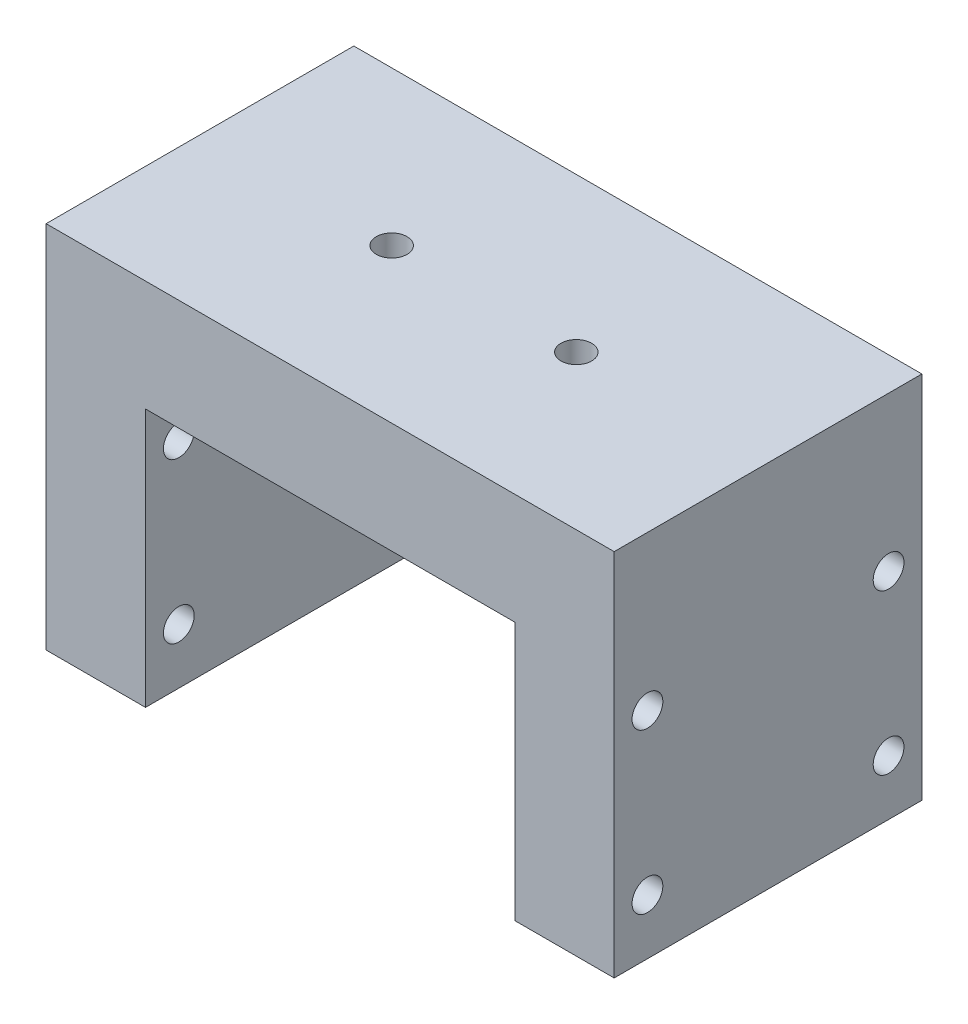
ISO-10303-21;
HEADER;
FILE_DESCRIPTION(('STEP AP214'),'2;1');
FILE_NAME('part.step','',(''),(''),'','','');
FILE_SCHEMA(('AUTOMOTIVE_DESIGN { 1 0 10303 214 1 1 1 1 }'));
ENDSEC;
DATA;
#1=APPLICATION_CONTEXT('core data for automotive mechanical design processes');
#2=APPLICATION_PROTOCOL_DEFINITION('international standard','automotive_design',2000,#1);
#3=PRODUCT_CONTEXT('',#1,'mechanical');
#4=PRODUCT('Part','Part','',(#3));
#5=PRODUCT_RELATED_PRODUCT_CATEGORY('part','',(#4));
#6=PRODUCT_DEFINITION_FORMATION('','',#4);
#7=PRODUCT_DEFINITION_CONTEXT('part definition',#1,'design');
#8=PRODUCT_DEFINITION('design','',#6,#7);
#9=PRODUCT_DEFINITION_SHAPE('','',#8);
#10=(LENGTH_UNIT() NAMED_UNIT(*) SI_UNIT(.MILLI.,.METRE.));
#11=(NAMED_UNIT(*) PLANE_ANGLE_UNIT() SI_UNIT($,.RADIAN.));
#12=(NAMED_UNIT(*) SI_UNIT($,.STERADIAN.) SOLID_ANGLE_UNIT());
#13=UNCERTAINTY_MEASURE_WITH_UNIT(LENGTH_MEASURE(1.E-05),#10,'distance_accuracy_value','');
#14=(GEOMETRIC_REPRESENTATION_CONTEXT(3) GLOBAL_UNCERTAINTY_ASSIGNED_CONTEXT((#13)) GLOBAL_UNIT_ASSIGNED_CONTEXT((#10,
#11,#12)) REPRESENTATION_CONTEXT('',''));
#15=CARTESIAN_POINT('',(0.,0.,0.));
#16=DIRECTION('',(0.,0.,1.));
#17=DIRECTION('',(1.,0.,0.));
#18=AXIS2_PLACEMENT_3D('',#15,#16,#17);
#19=CARTESIAN_POINT('',(-15.,-21.,12.5));
#20=DIRECTION('',(0.,1.,0.));
#21=DIRECTION('',(0.,0.,1.));
#22=AXIS2_PLACEMENT_3D('',#19,#20,#21);
#23=PLANE('',#22);
#24=DIRECTION('',(1.,0.,0.));
#25=VECTOR('',#24,1.);
#26=CARTESIAN_POINT('',(-15.,-21.,-12.5));
#27=LINE('',#26,#25);
#28=CARTESIAN_POINT('',(-23.075,-21.,-12.5));
#29=VERTEX_POINT('',#28);
#30=CARTESIAN_POINT('',(-15.,-21.,-12.5));
#31=VERTEX_POINT('',#30);
#32=EDGE_CURVE('E144',#29,#31,#27,.T.);
#33=ORIENTED_EDGE('',*,*,#32,.T.);
#34=DIRECTION('',(0.,0.,-1.));
#35=VECTOR('',#34,1.);
#36=CARTESIAN_POINT('',(-15.,-21.,12.5));
#37=LINE('',#36,#35);
#38=CARTESIAN_POINT('',(-15.,-21.,12.5));
#39=VERTEX_POINT('',#38);
#40=EDGE_CURVE('E11',#39,#31,#37,.T.);
#41=ORIENTED_EDGE('',*,*,#40,.F.);
#42=DIRECTION('',(1.,0.,0.));
#43=VECTOR('',#42,1.);
#44=CARTESIAN_POINT('',(-15.,-21.,12.5));
#45=LINE('',#44,#43);
#46=CARTESIAN_POINT('',(-23.075,-21.,12.5));
#47=VERTEX_POINT('',#46);
#48=EDGE_CURVE('E159',#47,#39,#45,.T.);
#49=ORIENTED_EDGE('',*,*,#48,.F.);
#50=DIRECTION('',(0.,0.,-1.));
#51=VECTOR('',#50,1.);
#52=CARTESIAN_POINT('',(-23.075,-21.,12.5));
#53=LINE('',#52,#51);
#54=EDGE_CURVE('E140',#47,#29,#53,.T.);
#55=ORIENTED_EDGE('',*,*,#54,.T.);
#56=EDGE_LOOP('',(#33,#41,#49,#55));
#57=FACE_BOUND('',#56,.T.);
#58=ADVANCED_FACE('F45',(#57),#23,.F.);
#59=CARTESIAN_POINT('',(-15.,0.,12.5));
#60=DIRECTION('',(-1.,0.,0.));
#61=DIRECTION('',(0.,-1.,0.));
#62=AXIS2_PLACEMENT_3D('',#59,#60,#61);
#63=PLANE('',#62);
#64=CARTESIAN_POINT('',(-15.,-3.53,-9.795));
#65=DIRECTION('',(-1.,0.,0.));
#66=DIRECTION('',(0.,-1.,0.));
#67=AXIS2_PLACEMENT_3D('',#64,#65,#66);
#68=CIRCLE('',#67,1.24999999999999);
#69=CARTESIAN_POINT('',(-15.,-4.77999999999999,-9.795));
#70=VERTEX_POINT('',#69);
#71=EDGE_CURVE('E239',#70,#70,#68,.T.);
#72=ORIENTED_EDGE('',*,*,#71,.T.);
#73=EDGE_LOOP('',(#72));
#74=FACE_BOUND('',#73,.T.);
#75=CARTESIAN_POINT('',(-15.,-16.5,9.795));
#76=DIRECTION('',(-1.,0.,0.));
#77=DIRECTION('',(0.,-1.,0.));
#78=AXIS2_PLACEMENT_3D('',#75,#76,#77);
#79=CIRCLE('',#78,1.24999999999999);
#80=CARTESIAN_POINT('',(-15.,-17.75,9.795));
#81=VERTEX_POINT('',#80);
#82=EDGE_CURVE('E227',#81,#81,#79,.T.);
#83=ORIENTED_EDGE('',*,*,#82,.T.);
#84=EDGE_LOOP('',(#83));
#85=FACE_BOUND('',#84,.T.);
#86=CARTESIAN_POINT('',(-15.,-16.5,-9.795));
#87=DIRECTION('',(-1.,0.,0.));
#88=DIRECTION('',(0.,-1.,0.));
#89=AXIS2_PLACEMENT_3D('',#86,#87,#88);
#90=CIRCLE('',#89,1.24999999999999);
#91=CARTESIAN_POINT('',(-15.,-17.75,-9.795));
#92=VERTEX_POINT('',#91);
#93=EDGE_CURVE('E215',#92,#92,#90,.T.);
#94=ORIENTED_EDGE('',*,*,#93,.T.);
#95=EDGE_LOOP('',(#94));
#96=FACE_BOUND('',#95,.T.);
#97=CARTESIAN_POINT('',(-15.,-3.53,9.795));
#98=DIRECTION('',(-1.,0.,0.));
#99=DIRECTION('',(0.,-1.,0.));
#100=AXIS2_PLACEMENT_3D('',#97,#98,#99);
#101=CIRCLE('',#100,1.24999999999999);
#102=CARTESIAN_POINT('',(-15.,-4.77999999999999,9.795));
#103=VERTEX_POINT('',#102);
#104=EDGE_CURVE('E203',#103,#103,#101,.T.);
#105=ORIENTED_EDGE('',*,*,#104,.T.);
#106=EDGE_LOOP('',(#105));
#107=FACE_BOUND('',#106,.T.);
#108=DIRECTION('',(0.,1.,0.));
#109=VECTOR('',#108,1.);
#110=CARTESIAN_POINT('',(-15.,0.,-12.5));
#111=LINE('',#110,#109);
#112=CARTESIAN_POINT('',(-15.,0.,-12.5));
#113=VERTEX_POINT('',#112);
#114=EDGE_CURVE('E147',#31,#113,#111,.T.);
#115=ORIENTED_EDGE('',*,*,#114,.T.);
#116=DIRECTION('',(0.,0.,-1.));
#117=VECTOR('',#116,1.);
#118=CARTESIAN_POINT('',(-15.,0.,12.5));
#119=LINE('',#118,#117);
#120=CARTESIAN_POINT('',(-15.,0.,12.5));
#121=VERTEX_POINT('',#120);
#122=EDGE_CURVE('E53',#121,#113,#119,.T.);
#123=ORIENTED_EDGE('',*,*,#122,.F.);
#124=DIRECTION('',(0.,1.,0.));
#125=VECTOR('',#124,1.);
#126=CARTESIAN_POINT('',(-15.,0.,12.5));
#127=LINE('',#126,#125);
#128=EDGE_CURVE('E105',#39,#121,#127,.T.);
#129=ORIENTED_EDGE('',*,*,#128,.F.);
#130=ORIENTED_EDGE('',*,*,#40,.T.);
#131=EDGE_LOOP('',(#115,#123,#129,#130));
#132=FACE_BOUND('',#131,.T.);
#133=ADVANCED_FACE('F273',(#74,#85,#96,#107,#132),#63,.F.);
#134=CARTESIAN_POINT('',(15.,0.,12.5));
#135=DIRECTION('',(0.,1.,0.));
#136=DIRECTION('',(-1.,0.,0.));
#137=AXIS2_PLACEMENT_3D('',#134,#135,#136);
#138=PLANE('',#137);
#139=DIRECTION('',(1.,0.,0.));
#140=VECTOR('',#139,1.);
#141=CARTESIAN_POINT('',(15.,0.,-12.5));
#142=LINE('',#141,#140);
#143=CARTESIAN_POINT('',(15.,0.,-12.5));
#144=VERTEX_POINT('',#143);
#145=EDGE_CURVE('E150',#113,#144,#142,.T.);
#146=ORIENTED_EDGE('',*,*,#145,.T.);
#147=DIRECTION('',(0.,0.,-1.));
#148=VECTOR('',#147,1.);
#149=CARTESIAN_POINT('',(15.,0.,12.5));
#150=LINE('',#149,#148);
#151=CARTESIAN_POINT('',(15.,0.,12.5));
#152=VERTEX_POINT('',#151);
#153=EDGE_CURVE('E166',#152,#144,#150,.T.);
#154=ORIENTED_EDGE('',*,*,#153,.F.);
#155=DIRECTION('',(1.,0.,0.));
#156=VECTOR('',#155,1.);
#157=CARTESIAN_POINT('',(15.,0.,12.5));
#158=LINE('',#157,#156);
#159=EDGE_CURVE('E174',#121,#152,#158,.T.);
#160=ORIENTED_EDGE('',*,*,#159,.F.);
#161=ORIENTED_EDGE('',*,*,#122,.T.);
#162=EDGE_LOOP('',(#146,#154,#160,#161));
#163=FACE_BOUND('',#162,.T.);
#164=ADVANCED_FACE('F172',(#163),#138,.F.);
#165=CARTESIAN_POINT('',(15.,-21.,12.5));
#166=DIRECTION('',(1.,0.,0.));
#167=DIRECTION('',(0.,1.,0.));
#168=AXIS2_PLACEMENT_3D('',#165,#166,#167);
#169=PLANE('',#168);
#170=CARTESIAN_POINT('',(15.,-3.53,-9.795));
#171=DIRECTION('',(1.,0.,0.));
#172=DIRECTION('',(0.,1.,0.));
#173=AXIS2_PLACEMENT_3D('',#170,#171,#172);
#174=CIRCLE('',#173,1.24999999999999);
#175=CARTESIAN_POINT('',(15.,-2.28000000000001,-9.795));
#176=VERTEX_POINT('',#175);
#177=EDGE_CURVE('E242',#176,#176,#174,.T.);
#178=ORIENTED_EDGE('',*,*,#177,.T.);
#179=EDGE_LOOP('',(#178));
#180=FACE_BOUND('',#179,.T.);
#181=CARTESIAN_POINT('',(15.,-16.5,9.795));
#182=DIRECTION('',(1.,0.,0.));
#183=DIRECTION('',(0.,1.,0.));
#184=AXIS2_PLACEMENT_3D('',#181,#182,#183);
#185=CIRCLE('',#184,1.24999999999999);
#186=CARTESIAN_POINT('',(15.,-15.25,9.795));
#187=VERTEX_POINT('',#186);
#188=EDGE_CURVE('E230',#187,#187,#185,.T.);
#189=ORIENTED_EDGE('',*,*,#188,.T.);
#190=EDGE_LOOP('',(#189));
#191=FACE_BOUND('',#190,.T.);
#192=CARTESIAN_POINT('',(15.,-16.5,-9.795));
#193=DIRECTION('',(1.,0.,0.));
#194=DIRECTION('',(0.,1.,0.));
#195=AXIS2_PLACEMENT_3D('',#192,#193,#194);
#196=CIRCLE('',#195,1.24999999999999);
#197=CARTESIAN_POINT('',(15.,-15.25,-9.795));
#198=VERTEX_POINT('',#197);
#199=EDGE_CURVE('E218',#198,#198,#196,.T.);
#200=ORIENTED_EDGE('',*,*,#199,.T.);
#201=EDGE_LOOP('',(#200));
#202=FACE_BOUND('',#201,.T.);
#203=CARTESIAN_POINT('',(15.,-3.53,9.795));
#204=DIRECTION('',(1.,0.,0.));
#205=DIRECTION('',(0.,1.,0.));
#206=AXIS2_PLACEMENT_3D('',#203,#204,#205);
#207=CIRCLE('',#206,1.24999999999999);
#208=CARTESIAN_POINT('',(15.,-2.28000000000001,9.795));
#209=VERTEX_POINT('',#208);
#210=EDGE_CURVE('E206',#209,#209,#207,.T.);
#211=ORIENTED_EDGE('',*,*,#210,.T.);
#212=EDGE_LOOP('',(#211));
#213=FACE_BOUND('',#212,.T.);
#214=DIRECTION('',(0.,-1.,0.));
#215=VECTOR('',#214,1.);
#216=CARTESIAN_POINT('',(15.,-21.,-12.5));
#217=LINE('',#216,#215);
#218=CARTESIAN_POINT('',(15.,-21.,-12.5));
#219=VERTEX_POINT('',#218);
#220=EDGE_CURVE('E152',#144,#219,#217,.T.);
#221=ORIENTED_EDGE('',*,*,#220,.T.);
#222=DIRECTION('',(0.,0.,-1.));
#223=VECTOR('',#222,1.);
#224=CARTESIAN_POINT('',(15.,-21.,12.5));
#225=LINE('',#224,#223);
#226=CARTESIAN_POINT('',(15.,-21.,12.5));
#227=VERTEX_POINT('',#226);
#228=EDGE_CURVE('E163',#227,#219,#225,.T.);
#229=ORIENTED_EDGE('',*,*,#228,.F.);
#230=DIRECTION('',(0.,-1.,0.));
#231=VECTOR('',#230,1.);
#232=CARTESIAN_POINT('',(15.,-21.,12.5));
#233=LINE('',#232,#231);
#234=EDGE_CURVE('E186',#152,#227,#233,.T.);
#235=ORIENTED_EDGE('',*,*,#234,.F.);
#236=ORIENTED_EDGE('',*,*,#153,.T.);
#237=EDGE_LOOP('',(#221,#229,#235,#236));
#238=FACE_BOUND('',#237,.T.);
#239=ADVANCED_FACE('F182',(#180,#191,#202,#213,#238),#169,.F.);
#240=CARTESIAN_POINT('',(23.075,-21.,12.5));
#241=DIRECTION('',(0.,1.,0.));
#242=DIRECTION('',(-1.,0.,0.));
#243=AXIS2_PLACEMENT_3D('',#240,#241,#242);
#244=PLANE('',#243);
#245=DIRECTION('',(1.,0.,0.));
#246=VECTOR('',#245,1.);
#247=CARTESIAN_POINT('',(23.075,-21.,-12.5));
#248=LINE('',#247,#246);
#249=CARTESIAN_POINT('',(23.075,-21.,-12.5));
#250=VERTEX_POINT('',#249);
#251=EDGE_CURVE('E154',#219,#250,#248,.T.);
#252=ORIENTED_EDGE('',*,*,#251,.T.);
#253=DIRECTION('',(0.,0.,-1.));
#254=VECTOR('',#253,1.);
#255=CARTESIAN_POINT('',(23.075,-21.,12.5));
#256=LINE('',#255,#254);
#257=CARTESIAN_POINT('',(23.075,-21.,12.5));
#258=VERTEX_POINT('',#257);
#259=EDGE_CURVE('E135',#258,#250,#256,.T.);
#260=ORIENTED_EDGE('',*,*,#259,.F.);
#261=DIRECTION('',(1.,0.,0.));
#262=VECTOR('',#261,1.);
#263=CARTESIAN_POINT('',(23.075,-21.,12.5));
#264=LINE('',#263,#262);
#265=EDGE_CURVE('E126',#227,#258,#264,.T.);
#266=ORIENTED_EDGE('',*,*,#265,.F.);
#267=ORIENTED_EDGE('',*,*,#228,.T.);
#268=EDGE_LOOP('',(#252,#260,#266,#267));
#269=FACE_BOUND('',#268,.T.);
#270=ADVANCED_FACE('F185',(#269),#244,.F.);
#271=CARTESIAN_POINT('',(23.075,9.00000000000001,12.5));
#272=DIRECTION('',(-1.,0.,0.));
#273=DIRECTION('',(0.,-1.,0.));
#274=AXIS2_PLACEMENT_3D('',#271,#272,#273);
#275=PLANE('',#274);
#276=CARTESIAN_POINT('',(23.075,-3.53,-9.795));
#277=DIRECTION('',(-1.,0.,0.));
#278=DIRECTION('',(0.,0.,1.));
#279=AXIS2_PLACEMENT_3D('',#276,#277,#278);
#280=CIRCLE('',#279,1.24999999999999);
#281=CARTESIAN_POINT('',(23.075,-3.53,-8.54500000000001));
#282=VERTEX_POINT('',#281);
#283=EDGE_CURVE('E245',#282,#282,#280,.T.);
#284=ORIENTED_EDGE('',*,*,#283,.T.);
#285=EDGE_LOOP('',(#284));
#286=FACE_BOUND('',#285,.T.);
#287=CARTESIAN_POINT('',(23.075,-16.5,9.795));
#288=DIRECTION('',(-1.,0.,0.));
#289=DIRECTION('',(0.,0.,1.));
#290=AXIS2_PLACEMENT_3D('',#287,#288,#289);
#291=CIRCLE('',#290,1.24999999999999);
#292=CARTESIAN_POINT('',(23.075,-16.5,11.045));
#293=VERTEX_POINT('',#292);
#294=EDGE_CURVE('E233',#293,#293,#291,.T.);
#295=ORIENTED_EDGE('',*,*,#294,.T.);
#296=EDGE_LOOP('',(#295));
#297=FACE_BOUND('',#296,.T.);
#298=CARTESIAN_POINT('',(23.075,-16.5,-9.795));
#299=DIRECTION('',(-1.,0.,0.));
#300=DIRECTION('',(0.,0.,1.));
#301=AXIS2_PLACEMENT_3D('',#298,#299,#300);
#302=CIRCLE('',#301,1.24999999999999);
#303=CARTESIAN_POINT('',(23.075,-16.5,-8.54500000000001));
#304=VERTEX_POINT('',#303);
#305=EDGE_CURVE('E221',#304,#304,#302,.T.);
#306=ORIENTED_EDGE('',*,*,#305,.T.);
#307=EDGE_LOOP('',(#306));
#308=FACE_BOUND('',#307,.T.);
#309=CARTESIAN_POINT('',(23.075,-3.53,9.795));
#310=DIRECTION('',(-1.,0.,0.));
#311=DIRECTION('',(0.,0.,1.));
#312=AXIS2_PLACEMENT_3D('',#309,#310,#311);
#313=CIRCLE('',#312,1.24999999999999);
#314=CARTESIAN_POINT('',(23.075,-3.53,11.045));
#315=VERTEX_POINT('',#314);
#316=EDGE_CURVE('E209',#315,#315,#313,.T.);
#317=ORIENTED_EDGE('',*,*,#316,.T.);
#318=EDGE_LOOP('',(#317));
#319=FACE_BOUND('',#318,.T.);
#320=DIRECTION('',(0.,1.,0.));
#321=VECTOR('',#320,1.);
#322=CARTESIAN_POINT('',(23.075,9.00000000000001,-12.5));
#323=LINE('',#322,#321);
#324=CARTESIAN_POINT('',(23.075,9.00000000000001,-12.5));
#325=VERTEX_POINT('',#324);
#326=EDGE_CURVE('E134',#250,#325,#323,.T.);
#327=ORIENTED_EDGE('',*,*,#326,.T.);
#328=DIRECTION('',(0.,0.,-1.));
#329=VECTOR('',#328,1.);
#330=CARTESIAN_POINT('',(23.075,9.00000000000001,12.5));
#331=LINE('',#330,#329);
#332=CARTESIAN_POINT('',(23.075,9.00000000000001,12.5));
#333=VERTEX_POINT('',#332);
#334=EDGE_CURVE('E131',#333,#325,#331,.T.);
#335=ORIENTED_EDGE('',*,*,#334,.F.);
#336=DIRECTION('',(0.,1.,0.));
#337=VECTOR('',#336,1.);
#338=CARTESIAN_POINT('',(23.075,9.00000000000001,12.5));
#339=LINE('',#338,#337);
#340=EDGE_CURVE('E120',#258,#333,#339,.T.);
#341=ORIENTED_EDGE('',*,*,#340,.F.);
#342=ORIENTED_EDGE('',*,*,#259,.T.);
#343=EDGE_LOOP('',(#327,#335,#341,#342));
#344=FACE_BOUND('',#343,.T.);
#345=ADVANCED_FACE('F132',(#286,#297,#308,#319,#344),#275,.F.);
#346=CARTESIAN_POINT('',(-23.075,8.99999999999999,12.5));
#347=DIRECTION('',(0.,-1.,0.));
#348=DIRECTION('',(1.,0.,0.));
#349=AXIS2_PLACEMENT_3D('',#346,#347,#348);
#350=PLANE('',#349);
#351=CARTESIAN_POINT('',(-7.5,9.,0.));
#352=DIRECTION('',(0.,1.,0.));
#353=DIRECTION('',(0.,0.,1.));
#354=AXIS2_PLACEMENT_3D('',#351,#352,#353);
#355=CIRCLE('',#354,1.25);
#356=CARTESIAN_POINT('',(-7.5,9.,1.25));
#357=VERTEX_POINT('',#356);
#358=EDGE_CURVE('E200',#357,#357,#355,.T.);
#359=ORIENTED_EDGE('',*,*,#358,.F.);
#360=EDGE_LOOP('',(#359));
#361=FACE_BOUND('',#360,.T.);
#362=CARTESIAN_POINT('',(7.5,9.,0.));
#363=DIRECTION('',(0.,1.,0.));
#364=DIRECTION('',(0.,0.,1.));
#365=AXIS2_PLACEMENT_3D('',#362,#363,#364);
#366=CIRCLE('',#365,1.25);
#367=CARTESIAN_POINT('',(7.5,9.,1.25));
#368=VERTEX_POINT('',#367);
#369=EDGE_CURVE('E194',#368,#368,#366,.T.);
#370=ORIENTED_EDGE('',*,*,#369,.F.);
#371=EDGE_LOOP('',(#370));
#372=FACE_BOUND('',#371,.T.);
#373=DIRECTION('',(-1.,0.,0.));
#374=VECTOR('',#373,1.);
#375=CARTESIAN_POINT('',(-23.075,8.99999999999999,-12.5));
#376=LINE('',#375,#374);
#377=CARTESIAN_POINT('',(-23.075,8.99999999999999,-12.5));
#378=VERTEX_POINT('',#377);
#379=EDGE_CURVE('E91',#325,#378,#376,.T.);
#380=ORIENTED_EDGE('',*,*,#379,.T.);
#381=DIRECTION('',(0.,0.,-1.));
#382=VECTOR('',#381,1.);
#383=CARTESIAN_POINT('',(-23.075,8.99999999999999,12.5));
#384=LINE('',#383,#382);
#385=CARTESIAN_POINT('',(-23.075,8.99999999999999,12.5));
#386=VERTEX_POINT('',#385);
#387=EDGE_CURVE('E136',#386,#378,#384,.T.);
#388=ORIENTED_EDGE('',*,*,#387,.F.);
#389=DIRECTION('',(-1.,0.,0.));
#390=VECTOR('',#389,1.);
#391=CARTESIAN_POINT('',(-23.075,8.99999999999999,12.5));
#392=LINE('',#391,#390);
#393=EDGE_CURVE('E124',#333,#386,#392,.T.);
#394=ORIENTED_EDGE('',*,*,#393,.F.);
#395=ORIENTED_EDGE('',*,*,#334,.T.);
#396=EDGE_LOOP('',(#380,#388,#394,#395));
#397=FACE_BOUND('',#396,.T.);
#398=ADVANCED_FACE('F138',(#361,#372,#397),#350,.F.);
#399=CARTESIAN_POINT('',(-23.075,-21.,12.5));
#400=DIRECTION('',(1.,0.,0.));
#401=DIRECTION('',(0.,1.,0.));
#402=AXIS2_PLACEMENT_3D('',#399,#400,#401);
#403=PLANE('',#402);
#404=CARTESIAN_POINT('',(-23.075,-3.53,-9.795));
#405=DIRECTION('',(-1.,0.,0.));
#406=DIRECTION('',(0.,0.,1.));
#407=AXIS2_PLACEMENT_3D('',#404,#405,#406);
#408=CIRCLE('',#407,1.24999999999999);
#409=CARTESIAN_POINT('',(-23.075,-3.53,-8.54500000000001));
#410=VERTEX_POINT('',#409);
#411=EDGE_CURVE('E248',#410,#410,#408,.T.);
#412=ORIENTED_EDGE('',*,*,#411,.F.);
#413=EDGE_LOOP('',(#412));
#414=FACE_BOUND('',#413,.T.);
#415=CARTESIAN_POINT('',(-23.075,-16.5,9.795));
#416=DIRECTION('',(-1.,0.,0.));
#417=DIRECTION('',(0.,0.,1.));
#418=AXIS2_PLACEMENT_3D('',#415,#416,#417);
#419=CIRCLE('',#418,1.24999999999999);
#420=CARTESIAN_POINT('',(-23.075,-16.5,11.045));
#421=VERTEX_POINT('',#420);
#422=EDGE_CURVE('E236',#421,#421,#419,.T.);
#423=ORIENTED_EDGE('',*,*,#422,.F.);
#424=EDGE_LOOP('',(#423));
#425=FACE_BOUND('',#424,.T.);
#426=CARTESIAN_POINT('',(-23.075,-16.5,-9.795));
#427=DIRECTION('',(-1.,0.,0.));
#428=DIRECTION('',(0.,0.,1.));
#429=AXIS2_PLACEMENT_3D('',#426,#427,#428);
#430=CIRCLE('',#429,1.24999999999999);
#431=CARTESIAN_POINT('',(-23.075,-16.5,-8.54500000000001));
#432=VERTEX_POINT('',#431);
#433=EDGE_CURVE('E224',#432,#432,#430,.T.);
#434=ORIENTED_EDGE('',*,*,#433,.F.);
#435=EDGE_LOOP('',(#434));
#436=FACE_BOUND('',#435,.T.);
#437=CARTESIAN_POINT('',(-23.075,-3.53,9.795));
#438=DIRECTION('',(-1.,0.,0.));
#439=DIRECTION('',(0.,0.,1.));
#440=AXIS2_PLACEMENT_3D('',#437,#438,#439);
#441=CIRCLE('',#440,1.24999999999999);
#442=CARTESIAN_POINT('',(-23.075,-3.53,11.045));
#443=VERTEX_POINT('',#442);
#444=EDGE_CURVE('E212',#443,#443,#441,.T.);
#445=ORIENTED_EDGE('',*,*,#444,.F.);
#446=EDGE_LOOP('',(#445));
#447=FACE_BOUND('',#446,.T.);
#448=DIRECTION('',(0.,-1.,0.));
#449=VECTOR('',#448,1.);
#450=CARTESIAN_POINT('',(-23.075,-21.,-12.5));
#451=LINE('',#450,#449);
#452=EDGE_CURVE('E97',#378,#29,#451,.T.);
#453=ORIENTED_EDGE('',*,*,#452,.T.);
#454=ORIENTED_EDGE('',*,*,#54,.F.);
#455=DIRECTION('',(0.,-1.,0.));
#456=VECTOR('',#455,1.);
#457=CARTESIAN_POINT('',(-23.075,-21.,12.5));
#458=LINE('',#457,#456);
#459=EDGE_CURVE('E61',#386,#47,#458,.T.);
#460=ORIENTED_EDGE('',*,*,#459,.F.);
#461=ORIENTED_EDGE('',*,*,#387,.T.);
#462=EDGE_LOOP('',(#453,#454,#460,#461));
#463=FACE_BOUND('',#462,.T.);
#464=ADVANCED_FACE('F255',(#414,#425,#436,#447,#463),#403,.F.);
#465=CARTESIAN_POINT('',(0.,0.,12.5));
#466=DIRECTION('',(0.,0.,-1.));
#467=DIRECTION('',(-1.,0.,0.));
#468=AXIS2_PLACEMENT_3D('',#465,#466,#467);
#469=PLANE('',#468);
#470=ORIENTED_EDGE('',*,*,#48,.T.);
#471=ORIENTED_EDGE('',*,*,#128,.T.);
#472=ORIENTED_EDGE('',*,*,#159,.T.);
#473=ORIENTED_EDGE('',*,*,#234,.T.);
#474=ORIENTED_EDGE('',*,*,#265,.T.);
#475=ORIENTED_EDGE('',*,*,#340,.T.);
#476=ORIENTED_EDGE('',*,*,#393,.T.);
#477=ORIENTED_EDGE('',*,*,#459,.T.);
#478=EDGE_LOOP('',(#470,#471,#472,#473,#474,#475,#476,#477));
#479=FACE_BOUND('',#478,.T.);
#480=ADVANCED_FACE('F122',(#479),#469,.F.);
#481=CARTESIAN_POINT('',(0.,0.,-12.5));
#482=DIRECTION('',(0.,0.,-1.));
#483=DIRECTION('',(-1.,0.,0.));
#484=AXIS2_PLACEMENT_3D('',#481,#482,#483);
#485=PLANE('',#484);
#486=ORIENTED_EDGE('',*,*,#32,.F.);
#487=ORIENTED_EDGE('',*,*,#452,.F.);
#488=ORIENTED_EDGE('',*,*,#379,.F.);
#489=ORIENTED_EDGE('',*,*,#326,.F.);
#490=ORIENTED_EDGE('',*,*,#251,.F.);
#491=ORIENTED_EDGE('',*,*,#220,.F.);
#492=ORIENTED_EDGE('',*,*,#145,.F.);
#493=ORIENTED_EDGE('',*,*,#114,.F.);
#494=EDGE_LOOP('',(#486,#487,#488,#489,#490,#491,#492,#493));
#495=FACE_BOUND('',#494,.T.);
#496=ADVANCED_FACE('F178',(#495),#485,.T.);
#497=CARTESIAN_POINT('',(7.5,1.,0.));
#498=DIRECTION('',(0.,1.,0.));
#499=DIRECTION('',(0.,0.,1.));
#500=AXIS2_PLACEMENT_3D('',#497,#498,#499);
#501=CONICAL_SURFACE('',#500,1.25,1.02974425867665);
#502=CARTESIAN_POINT('',(7.5,0.248924226215549,0.));
#503=VERTEX_POINT('',#502);
#504=VERTEX_LOOP('',#503);
#505=FACE_BOUND('',#504,.T.);
#506=CARTESIAN_POINT('',(7.5,1.,0.));
#507=DIRECTION('',(0.,1.,0.));
#508=DIRECTION('',(0.,0.,1.));
#509=AXIS2_PLACEMENT_3D('',#506,#507,#508);
#510=CIRCLE('',#509,1.25);
#511=CARTESIAN_POINT('',(7.5,1.,1.24999999999999));
#512=VERTEX_POINT('',#511);
#513=EDGE_CURVE('E148',#512,#512,#510,.T.);
#514=ORIENTED_EDGE('',*,*,#513,.T.);
#515=EDGE_LOOP('',(#514));
#516=FACE_BOUND('',#515,.T.);
#517=ADVANCED_FACE('F338',(#505,#516),#501,.F.);
#518=CARTESIAN_POINT('',(7.5,9.,0.));
#519=DIRECTION('',(0.,1.,0.));
#520=DIRECTION('',(0.,0.,1.));
#521=AXIS2_PLACEMENT_3D('',#518,#519,#520);
#522=CYLINDRICAL_SURFACE('',#521,1.25);
#523=ORIENTED_EDGE('',*,*,#513,.F.);
#524=EDGE_LOOP('',(#523));
#525=FACE_BOUND('',#524,.T.);
#526=ORIENTED_EDGE('',*,*,#369,.T.);
#527=EDGE_LOOP('',(#526));
#528=FACE_BOUND('',#527,.T.);
#529=ADVANCED_FACE('F346',(#525,#528),#522,.F.);
#530=CARTESIAN_POINT('',(-7.5,0.999999999999997,0.));
#531=DIRECTION('',(0.,1.,0.));
#532=DIRECTION('',(0.,0.,1.));
#533=AXIS2_PLACEMENT_3D('',#530,#531,#532);
#534=CONICAL_SURFACE('',#533,1.25,1.02974425867665);
#535=CARTESIAN_POINT('',(-7.5,0.248924226215546,0.));
#536=VERTEX_POINT('',#535);
#537=VERTEX_LOOP('',#536);
#538=FACE_BOUND('',#537,.T.);
#539=CARTESIAN_POINT('',(-7.5,0.999999999999997,0.));
#540=DIRECTION('',(0.,1.,0.));
#541=DIRECTION('',(0.,0.,1.));
#542=AXIS2_PLACEMENT_3D('',#539,#540,#541);
#543=CIRCLE('',#542,1.25);
#544=CARTESIAN_POINT('',(-7.5,0.999999999999997,1.25));
#545=VERTEX_POINT('',#544);
#546=EDGE_CURVE('E197',#545,#545,#543,.T.);
#547=ORIENTED_EDGE('',*,*,#546,.T.);
#548=EDGE_LOOP('',(#547));
#549=FACE_BOUND('',#548,.T.);
#550=ADVANCED_FACE('F354',(#538,#549),#534,.F.);
#551=CARTESIAN_POINT('',(-7.5,9.,0.));
#552=DIRECTION('',(0.,1.,0.));
#553=DIRECTION('',(0.,0.,1.));
#554=AXIS2_PLACEMENT_3D('',#551,#552,#553);
#555=CYLINDRICAL_SURFACE('',#554,1.25);
#556=ORIENTED_EDGE('',*,*,#546,.F.);
#557=EDGE_LOOP('',(#556));
#558=FACE_BOUND('',#557,.T.);
#559=ORIENTED_EDGE('',*,*,#358,.T.);
#560=EDGE_LOOP('',(#559));
#561=FACE_BOUND('',#560,.T.);
#562=ADVANCED_FACE('F269',(#558,#561),#555,.F.);
#563=CARTESIAN_POINT('',(-23.075,-3.53,9.795));
#564=DIRECTION('',(-1.,0.,0.));
#565=DIRECTION('',(0.,0.,1.));
#566=AXIS2_PLACEMENT_3D('',#563,#564,#565);
#567=CYLINDRICAL_SURFACE('',#566,1.24999999999999);
#568=ORIENTED_EDGE('',*,*,#444,.T.);
#569=EDGE_LOOP('',(#568));
#570=FACE_BOUND('',#569,.T.);
#571=ORIENTED_EDGE('',*,*,#104,.F.);
#572=EDGE_LOOP('',(#571));
#573=FACE_BOUND('',#572,.T.);
#574=ADVANCED_FACE('F265',(#570,#573),#567,.F.);
#575=ORIENTED_EDGE('',*,*,#316,.F.);
#576=EDGE_LOOP('',(#575));
#577=FACE_BOUND('',#576,.T.);
#578=ORIENTED_EDGE('',*,*,#210,.F.);
#579=EDGE_LOOP('',(#578));
#580=FACE_BOUND('',#579,.T.);
#581=ADVANCED_FACE('F268',(#577,#580),#567,.F.);
#582=CARTESIAN_POINT('',(-23.075,-16.5,-9.795));
#583=DIRECTION('',(-1.,0.,0.));
#584=DIRECTION('',(0.,0.,1.));
#585=AXIS2_PLACEMENT_3D('',#582,#583,#584);
#586=CYLINDRICAL_SURFACE('',#585,1.24999999999999);
#587=ORIENTED_EDGE('',*,*,#433,.T.);
#588=EDGE_LOOP('',(#587));
#589=FACE_BOUND('',#588,.T.);
#590=ORIENTED_EDGE('',*,*,#93,.F.);
#591=EDGE_LOOP('',(#590));
#592=FACE_BOUND('',#591,.T.);
#593=ADVANCED_FACE('F379',(#589,#592),#586,.F.);
#594=ORIENTED_EDGE('',*,*,#305,.F.);
#595=EDGE_LOOP('',(#594));
#596=FACE_BOUND('',#595,.T.);
#597=ORIENTED_EDGE('',*,*,#199,.F.);
#598=EDGE_LOOP('',(#597));
#599=FACE_BOUND('',#598,.T.);
#600=ADVANCED_FACE('F386',(#596,#599),#586,.F.);
#601=CARTESIAN_POINT('',(-23.075,-16.5,9.795));
#602=DIRECTION('',(-1.,0.,0.));
#603=DIRECTION('',(0.,0.,1.));
#604=AXIS2_PLACEMENT_3D('',#601,#602,#603);
#605=CYLINDRICAL_SURFACE('',#604,1.24999999999999);
#606=ORIENTED_EDGE('',*,*,#422,.T.);
#607=EDGE_LOOP('',(#606));
#608=FACE_BOUND('',#607,.T.);
#609=ORIENTED_EDGE('',*,*,#82,.F.);
#610=EDGE_LOOP('',(#609));
#611=FACE_BOUND('',#610,.T.);
#612=ADVANCED_FACE('F394',(#608,#611),#605,.F.);
#613=ORIENTED_EDGE('',*,*,#294,.F.);
#614=EDGE_LOOP('',(#613));
#615=FACE_BOUND('',#614,.T.);
#616=ORIENTED_EDGE('',*,*,#188,.F.);
#617=EDGE_LOOP('',(#616));
#618=FACE_BOUND('',#617,.T.);
#619=ADVANCED_FACE('F401',(#615,#618),#605,.F.);
#620=CARTESIAN_POINT('',(-23.075,-3.53,-9.795));
#621=DIRECTION('',(-1.,0.,0.));
#622=DIRECTION('',(0.,0.,1.));
#623=AXIS2_PLACEMENT_3D('',#620,#621,#622);
#624=CYLINDRICAL_SURFACE('',#623,1.24999999999999);
#625=ORIENTED_EDGE('',*,*,#411,.T.);
#626=EDGE_LOOP('',(#625));
#627=FACE_BOUND('',#626,.T.);
#628=ORIENTED_EDGE('',*,*,#71,.F.);
#629=EDGE_LOOP('',(#628));
#630=FACE_BOUND('',#629,.T.);
#631=ADVANCED_FACE('F252',(#627,#630),#624,.F.);
#632=ORIENTED_EDGE('',*,*,#283,.F.);
#633=EDGE_LOOP('',(#632));
#634=FACE_BOUND('',#633,.T.);
#635=ORIENTED_EDGE('',*,*,#177,.F.);
#636=EDGE_LOOP('',(#635));
#637=FACE_BOUND('',#636,.T.);
#638=ADVANCED_FACE('F415',(#634,#637),#624,.F.);
#639=CLOSED_SHELL('',(#58,#133,#164,#239,#270,#345,#398,#464,#480,#496,#517,#529,#550,#562,#574,
#581,#593,#600,#612,#619,#631,#638));
#640=MANIFOLD_SOLID_BREP('B2',#639);
#641=ADVANCED_BREP_SHAPE_REPRESENTATION('',(#18,#640),#14);
#642=SHAPE_DEFINITION_REPRESENTATION(#9,#641);
ENDSEC;
END-ISO-10303-21;
